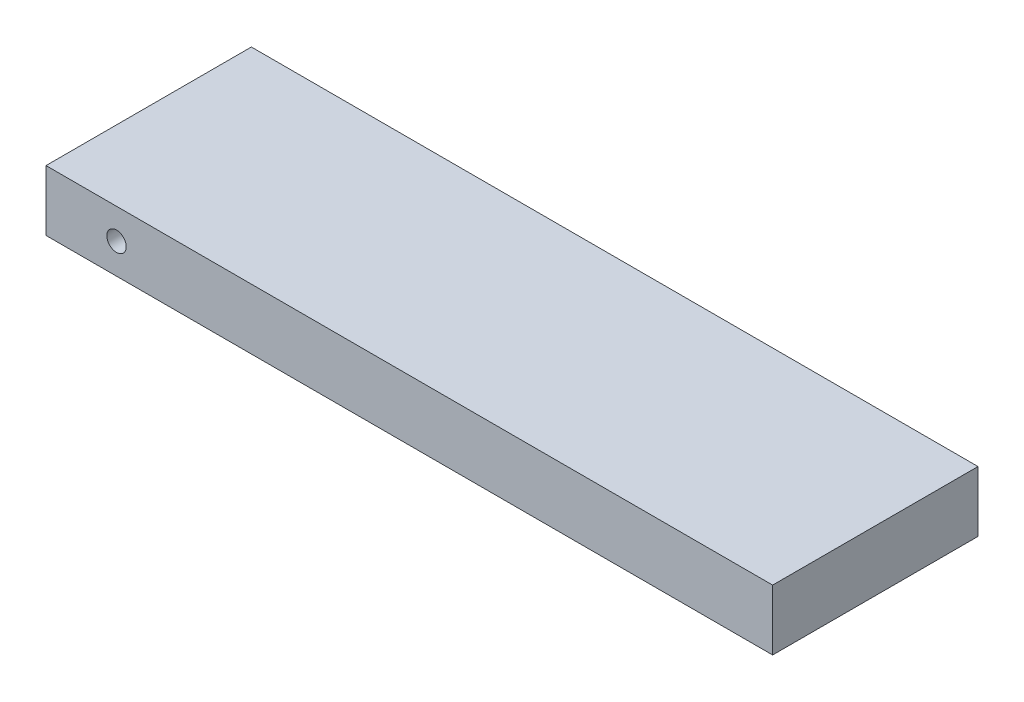
ISO-10303-21;
HEADER;
FILE_DESCRIPTION(('STEP AP214'),'2;1');
FILE_NAME('part.step','',(''),(''),'','','');
FILE_SCHEMA(('AUTOMOTIVE_DESIGN { 1 0 10303 214 1 1 1 1 }'));
ENDSEC;
DATA;
#1=APPLICATION_CONTEXT('core data for automotive mechanical design processes');
#2=APPLICATION_PROTOCOL_DEFINITION('international standard','automotive_design',2000,#1);
#3=PRODUCT_CONTEXT('',#1,'mechanical');
#4=PRODUCT('Part','Part','',(#3));
#5=PRODUCT_RELATED_PRODUCT_CATEGORY('part','',(#4));
#6=PRODUCT_DEFINITION_FORMATION('','',#4);
#7=PRODUCT_DEFINITION_CONTEXT('part definition',#1,'design');
#8=PRODUCT_DEFINITION('design','',#6,#7);
#9=PRODUCT_DEFINITION_SHAPE('','',#8);
#10=(LENGTH_UNIT() NAMED_UNIT(*) SI_UNIT(.MILLI.,.METRE.));
#11=(NAMED_UNIT(*) PLANE_ANGLE_UNIT() SI_UNIT($,.RADIAN.));
#12=(NAMED_UNIT(*) SI_UNIT($,.STERADIAN.) SOLID_ANGLE_UNIT());
#13=UNCERTAINTY_MEASURE_WITH_UNIT(LENGTH_MEASURE(1.E-05),#10,'distance_accuracy_value','');
#14=(GEOMETRIC_REPRESENTATION_CONTEXT(3) GLOBAL_UNCERTAINTY_ASSIGNED_CONTEXT((#13)) GLOBAL_UNIT_ASSIGNED_CONTEXT((#10,
#11,#12)) REPRESENTATION_CONTEXT('',''));
#15=CARTESIAN_POINT('',(0.,0.,0.));
#16=DIRECTION('',(0.,0.,1.));
#17=DIRECTION('',(1.,0.,0.));
#18=AXIS2_PLACEMENT_3D('',#15,#16,#17);
#19=CARTESIAN_POINT('',(-50.2302764407861,5.,307.948531114577));
#20=DIRECTION('',(1.,0.,0.));
#21=DIRECTION('',(0.,0.,-1.));
#22=AXIS2_PLACEMENT_3D('',#19,#20,#21);
#23=PLANE('',#22);
#24=DIRECTION('',(0.,0.,1.));
#25=VECTOR('',#24,1.);
#26=CARTESIAN_POINT('',(-50.2302764407861,0.,307.948531114577));
#27=LINE('',#26,#25);
#28=CARTESIAN_POINT('',(-50.2302764407861,0.,307.948531114577));
#29=VERTEX_POINT('',#28);
#30=CARTESIAN_POINT('',(-50.2302764407861,0.,324.905815414436));
#31=VERTEX_POINT('',#30);
#32=EDGE_CURVE('E96',#29,#31,#27,.T.);
#33=ORIENTED_EDGE('',*,*,#32,.T.);
#34=DIRECTION('',(0.,-1.,0.));
#35=VECTOR('',#34,1.);
#36=CARTESIAN_POINT('',(-50.2302764407861,5.,324.905815414436));
#37=LINE('',#36,#35);
#38=CARTESIAN_POINT('',(-50.2302764407861,5.,324.905815414436));
#39=VERTEX_POINT('',#38);
#40=EDGE_CURVE('E11',#39,#31,#37,.T.);
#41=ORIENTED_EDGE('',*,*,#40,.F.);
#42=DIRECTION('',(0.,0.,1.));
#43=VECTOR('',#42,1.);
#44=CARTESIAN_POINT('',(-50.2302764407861,5.,307.948531114577));
#45=LINE('',#44,#43);
#46=CARTESIAN_POINT('',(-50.2302764407861,5.,307.948531114577));
#47=VERTEX_POINT('',#46);
#48=EDGE_CURVE('E82',#47,#39,#45,.T.);
#49=ORIENTED_EDGE('',*,*,#48,.F.);
#50=DIRECTION('',(0.,-1.,0.));
#51=VECTOR('',#50,1.);
#52=CARTESIAN_POINT('',(-50.2302764407861,5.,307.948531114577));
#53=LINE('',#52,#51);
#54=EDGE_CURVE('E49',#47,#29,#53,.T.);
#55=ORIENTED_EDGE('',*,*,#54,.T.);
#56=EDGE_LOOP('',(#33,#41,#49,#55));
#57=FACE_BOUND('',#56,.T.);
#58=ADVANCED_FACE('F33',(#57),#23,.F.);
#59=CARTESIAN_POINT('',(-50.2302764407861,5.,324.905815414436));
#60=DIRECTION('',(0.,0.,-1.));
#61=DIRECTION('',(-1.,0.,0.));
#62=AXIS2_PLACEMENT_3D('',#59,#60,#61);
#63=PLANE('',#62);
#64=CARTESIAN_POINT('',(-44.4068352034535,2.5,324.905815414436));
#65=DIRECTION('',(0.,0.,1.));
#66=DIRECTION('',(1.,0.,0.));
#67=AXIS2_PLACEMENT_3D('',#64,#65,#66);
#68=CIRCLE('',#67,0.799999999999988);
#69=CARTESIAN_POINT('',(-43.6068352034535,2.5,324.905815414436));
#70=VERTEX_POINT('',#69);
#71=EDGE_CURVE('E110',#70,#70,#68,.T.);
#72=ORIENTED_EDGE('',*,*,#71,.F.);
#73=EDGE_LOOP('',(#72));
#74=FACE_BOUND('',#73,.T.);
#75=DIRECTION('',(1.,0.,0.));
#76=VECTOR('',#75,1.);
#77=CARTESIAN_POINT('',(-50.2302764407861,0.,324.905815414436));
#78=LINE('',#77,#76);
#79=CARTESIAN_POINT('',(9.7697235592139,0.,324.905815414436));
#80=VERTEX_POINT('',#79);
#81=EDGE_CURVE('E87',#31,#80,#78,.T.);
#82=ORIENTED_EDGE('',*,*,#81,.T.);
#83=DIRECTION('',(0.,-1.,0.));
#84=VECTOR('',#83,1.);
#85=CARTESIAN_POINT('',(9.7697235592139,5.,324.905815414436));
#86=LINE('',#85,#84);
#87=CARTESIAN_POINT('',(9.7697235592139,5.,324.905815414436));
#88=VERTEX_POINT('',#87);
#89=EDGE_CURVE('E41',#88,#80,#86,.T.);
#90=ORIENTED_EDGE('',*,*,#89,.F.);
#91=DIRECTION('',(1.,0.,0.));
#92=VECTOR('',#91,1.);
#93=CARTESIAN_POINT('',(-50.2302764407861,5.,324.905815414436));
#94=LINE('',#93,#92);
#95=EDGE_CURVE('E74',#39,#88,#94,.T.);
#96=ORIENTED_EDGE('',*,*,#95,.F.);
#97=ORIENTED_EDGE('',*,*,#40,.T.);
#98=EDGE_LOOP('',(#82,#90,#96,#97));
#99=FACE_BOUND('',#98,.T.);
#100=ADVANCED_FACE('F86',(#74,#99),#63,.F.);
#101=CARTESIAN_POINT('',(9.7697235592139,5.,307.948531114577));
#102=DIRECTION('',(1.,0.,0.));
#103=DIRECTION('',(0.,0.,-1.));
#104=AXIS2_PLACEMENT_3D('',#101,#102,#103);
#105=PLANE('',#104);
#106=DIRECTION('',(0.,0.,1.));
#107=VECTOR('',#106,1.);
#108=CARTESIAN_POINT('',(9.7697235592139,0.,307.948531114577));
#109=LINE('',#108,#107);
#110=CARTESIAN_POINT('',(9.7697235592139,0.,307.948531114577));
#111=VERTEX_POINT('',#110);
#112=EDGE_CURVE('E100',#111,#80,#109,.T.);
#113=ORIENTED_EDGE('',*,*,#112,.F.);
#114=DIRECTION('',(0.,-1.,0.));
#115=VECTOR('',#114,1.);
#116=CARTESIAN_POINT('',(9.7697235592139,5.,307.948531114577));
#117=LINE('',#116,#115);
#118=CARTESIAN_POINT('',(9.7697235592139,5.,307.948531114577));
#119=VERTEX_POINT('',#118);
#120=EDGE_CURVE('E63',#119,#111,#117,.T.);
#121=ORIENTED_EDGE('',*,*,#120,.F.);
#122=DIRECTION('',(0.,0.,1.));
#123=VECTOR('',#122,1.);
#124=CARTESIAN_POINT('',(9.7697235592139,5.,307.948531114577));
#125=LINE('',#124,#123);
#126=EDGE_CURVE('E81',#119,#88,#125,.T.);
#127=ORIENTED_EDGE('',*,*,#126,.T.);
#128=ORIENTED_EDGE('',*,*,#89,.T.);
#129=EDGE_LOOP('',(#113,#121,#127,#128));
#130=FACE_BOUND('',#129,.T.);
#131=ADVANCED_FACE('F90',(#130),#105,.T.);
#132=CARTESIAN_POINT('',(-50.2302764407861,5.,307.948531114577));
#133=DIRECTION('',(0.,0.,-1.));
#134=DIRECTION('',(-1.,0.,0.));
#135=AXIS2_PLACEMENT_3D('',#132,#133,#134);
#136=PLANE('',#135);
#137=CARTESIAN_POINT('',(-44.4068352034535,2.5,307.948531114577));
#138=DIRECTION('',(0.,0.,1.));
#139=DIRECTION('',(1.,0.,0.));
#140=AXIS2_PLACEMENT_3D('',#137,#138,#139);
#141=CIRCLE('',#140,0.799999999999995);
#142=CARTESIAN_POINT('',(-43.6068352034535,2.5,307.948531114577));
#143=VERTEX_POINT('',#142);
#144=EDGE_CURVE('E98',#143,#143,#141,.T.);
#145=ORIENTED_EDGE('',*,*,#144,.T.);
#146=EDGE_LOOP('',(#145));
#147=FACE_BOUND('',#146,.T.);
#148=DIRECTION('',(1.,0.,0.));
#149=VECTOR('',#148,1.);
#150=CARTESIAN_POINT('',(-50.2302764407861,0.,307.948531114577));
#151=LINE('',#150,#149);
#152=EDGE_CURVE('E102',#29,#111,#151,.T.);
#153=ORIENTED_EDGE('',*,*,#152,.F.);
#154=ORIENTED_EDGE('',*,*,#54,.F.);
#155=DIRECTION('',(1.,0.,0.));
#156=VECTOR('',#155,1.);
#157=CARTESIAN_POINT('',(-50.2302764407861,5.,307.948531114577));
#158=LINE('',#157,#156);
#159=EDGE_CURVE('E91',#47,#119,#158,.T.);
#160=ORIENTED_EDGE('',*,*,#159,.T.);
#161=ORIENTED_EDGE('',*,*,#120,.T.);
#162=EDGE_LOOP('',(#153,#154,#160,#161));
#163=FACE_BOUND('',#162,.T.);
#164=ADVANCED_FACE('F121',(#147,#163),#136,.T.);
#165=CARTESIAN_POINT('',(0.,5.,0.));
#166=DIRECTION('',(0.,1.,0.));
#167=DIRECTION('',(0.,0.,1.));
#168=AXIS2_PLACEMENT_3D('',#165,#166,#167);
#169=PLANE('',#168);
#170=ORIENTED_EDGE('',*,*,#48,.T.);
#171=ORIENTED_EDGE('',*,*,#95,.T.);
#172=ORIENTED_EDGE('',*,*,#126,.F.);
#173=ORIENTED_EDGE('',*,*,#159,.F.);
#174=EDGE_LOOP('',(#170,#171,#172,#173));
#175=FACE_BOUND('',#174,.T.);
#176=ADVANCED_FACE('F78',(#175),#169,.T.);
#177=CARTESIAN_POINT('',(0.,0.,0.));
#178=DIRECTION('',(0.,1.,0.));
#179=DIRECTION('',(0.,0.,1.));
#180=AXIS2_PLACEMENT_3D('',#177,#178,#179);
#181=PLANE('',#180);
#182=ORIENTED_EDGE('',*,*,#32,.F.);
#183=ORIENTED_EDGE('',*,*,#152,.T.);
#184=ORIENTED_EDGE('',*,*,#112,.T.);
#185=ORIENTED_EDGE('',*,*,#81,.F.);
#186=EDGE_LOOP('',(#182,#183,#184,#185));
#187=FACE_BOUND('',#186,.T.);
#188=ADVANCED_FACE('F127',(#187),#181,.F.);
#189=CARTESIAN_POINT('',(-44.4068352034535,2.5,324.905815414436));
#190=DIRECTION('',(0.,0.,1.));
#191=DIRECTION('',(1.,0.,0.));
#192=AXIS2_PLACEMENT_3D('',#189,#190,#191);
#193=CYLINDRICAL_SURFACE('',#192,0.799999999999992);
#194=ORIENTED_EDGE('',*,*,#144,.F.);
#195=EDGE_LOOP('',(#194));
#196=FACE_BOUND('',#195,.T.);
#197=ORIENTED_EDGE('',*,*,#71,.T.);
#198=EDGE_LOOP('',(#197));
#199=FACE_BOUND('',#198,.T.);
#200=ADVANCED_FACE('F114',(#196,#199),#193,.F.);
#201=CLOSED_SHELL('',(#58,#100,#131,#164,#176,#188,#200));
#202=MANIFOLD_SOLID_BREP('B2',#201);
#203=ADVANCED_BREP_SHAPE_REPRESENTATION('',(#18,#202),#14);
#204=SHAPE_DEFINITION_REPRESENTATION(#9,#203);
ENDSEC;
END-ISO-10303-21;
